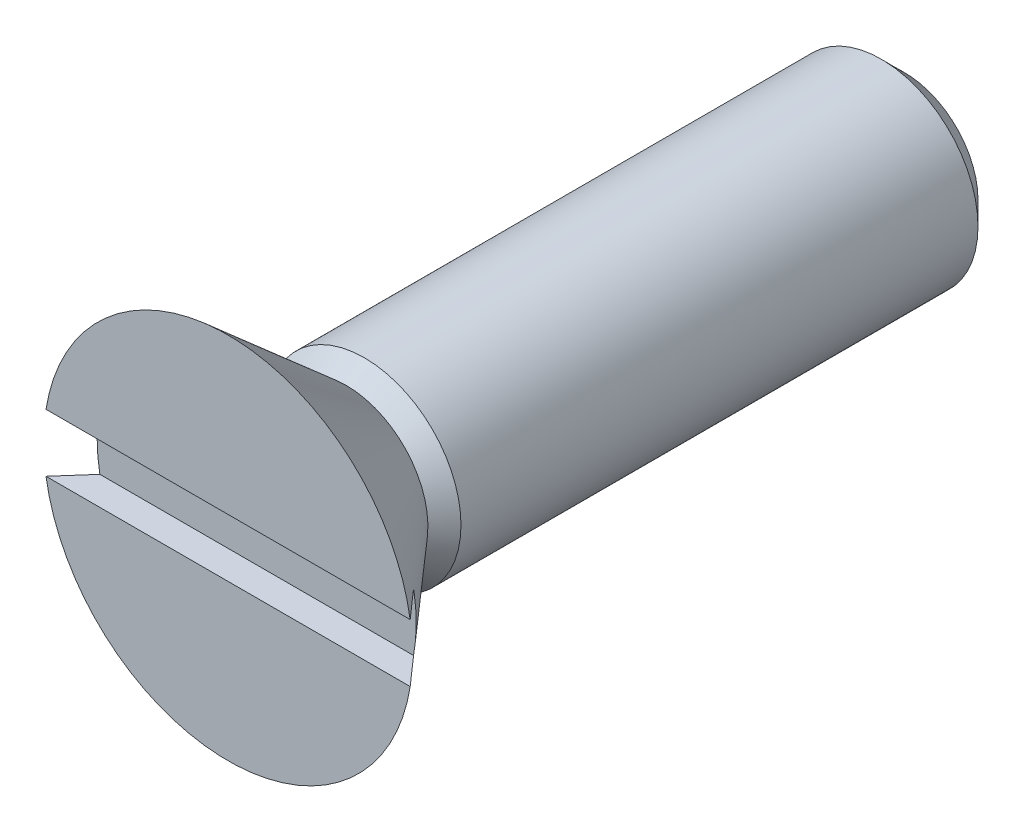
ISO-10303-21;
HEADER;
FILE_DESCRIPTION(('STEP AP214'),'2;1');
FILE_NAME('part.step','',(''),(''),'','','');
FILE_SCHEMA(('AUTOMOTIVE_DESIGN { 1 0 10303 214 1 1 1 1 }'));
ENDSEC;
DATA;
#1=APPLICATION_CONTEXT('core data for automotive mechanical design processes');
#2=APPLICATION_PROTOCOL_DEFINITION('international standard','automotive_design',2000,#1);
#3=PRODUCT_CONTEXT('',#1,'mechanical');
#4=PRODUCT('Part','Part','',(#3));
#5=PRODUCT_RELATED_PRODUCT_CATEGORY('part','',(#4));
#6=PRODUCT_DEFINITION_FORMATION('','',#4);
#7=PRODUCT_DEFINITION_CONTEXT('part definition',#1,'design');
#8=PRODUCT_DEFINITION('design','',#6,#7);
#9=PRODUCT_DEFINITION_SHAPE('','',#8);
#10=(LENGTH_UNIT() NAMED_UNIT(*) SI_UNIT(.MILLI.,.METRE.));
#11=(NAMED_UNIT(*) PLANE_ANGLE_UNIT() SI_UNIT($,.RADIAN.));
#12=(NAMED_UNIT(*) SI_UNIT($,.STERADIAN.) SOLID_ANGLE_UNIT());
#13=UNCERTAINTY_MEASURE_WITH_UNIT(LENGTH_MEASURE(1.E-05),#10,'distance_accuracy_value','');
#14=(GEOMETRIC_REPRESENTATION_CONTEXT(3) GLOBAL_UNCERTAINTY_ASSIGNED_CONTEXT((#13)) GLOBAL_UNIT_ASSIGNED_CONTEXT((#10,
#11,#12)) REPRESENTATION_CONTEXT('',''));
#15=CARTESIAN_POINT('',(0.,0.,0.));
#16=DIRECTION('',(0.,0.,1.));
#17=DIRECTION('',(1.,0.,0.));
#18=AXIS2_PLACEMENT_3D('',#15,#16,#17);
#19=CARTESIAN_POINT('',(-2.441956,-2.441956,0.));
#20=DIRECTION('',(0.,0.,1.));
#21=DIRECTION('',(1.,0.,0.));
#22=AXIS2_PLACEMENT_3D('',#19,#20,#21);
#23=PLANE('',#22);
#24=CARTESIAN_POINT('',(0.,0.,0.));
#25=DIRECTION('',(0.,0.,1.));
#26=DIRECTION('',(1.,0.,0.));
#27=AXIS2_PLACEMENT_3D('',#24,#25,#26);
#28=CIRCLE('',#27,2.413);
#29=CARTESIAN_POINT('',(2.413,0.,0.));
#30=VERTEX_POINT('',#29);
#31=EDGE_CURVE('E94',#30,#30,#28,.F.);
#32=ORIENTED_EDGE('',*,*,#31,.T.);
#33=EDGE_LOOP('',(#32));
#34=FACE_BOUND('',#33,.T.);
#35=ADVANCED_FACE('F17',(#34),#23,.F.);
#36=CARTESIAN_POINT('',(-6.054339894,-0.9525,21.2852));
#37=DIRECTION('',(0.,1.,0.));
#38=DIRECTION('',(0.,0.,1.));
#39=AXIS2_PLACEMENT_3D('',#36,#37,#38);
#40=PLANE('',#39);
#41=DIRECTION('',(1.,0.,0.));
#42=VECTOR('',#41,1.);
#43=CARTESIAN_POINT('',(0.,-0.9525,21.2852));
#44=LINE('',#43,#42);
#45=CARTESIAN_POINT('',(-5.15366288691652,-0.9525,21.2851999998263));
#46=VERTEX_POINT('',#45);
#47=CARTESIAN_POINT('',(5.15366288691652,-0.9525,21.2851999998263));
#48=VERTEX_POINT('',#47);
#49=EDGE_CURVE('E65',#46,#48,#44,.T.);
#50=ORIENTED_EDGE('',*,*,#49,.F.);
#51=CARTESIAN_POINT('',(-5.15366288549431,-0.9525,21.2851999982556));
#52=CARTESIAN_POINT('',(-5.5381400411626,-0.9525,21.7201245729036));
#53=CARTESIAN_POINT('',(-5.98254930127049,-0.9525,22.2249999983572));
#54=B_SPLINE_CURVE_WITH_KNOTS('',2,(#51,#52,#53),.UNSPECIFIED.,.F.,.F.,(3,3),(0.,1.),.UNSPECIFIED.);
#55=CARTESIAN_POINT('',(-5.98254930201713,-0.9525,22.2249999991786));
#56=VERTEX_POINT('',#55);
#57=EDGE_CURVE('E70',#46,#56,#54,.T.);
#58=ORIENTED_EDGE('',*,*,#57,.T.);
#59=DIRECTION('',(-1.,0.,0.));
#60=VECTOR('',#59,1.);
#61=CARTESIAN_POINT('',(0.,-0.9525,22.225));
#62=LINE('',#61,#60);
#63=CARTESIAN_POINT('',(5.98254930201713,-0.9525,22.2249999991786));
#64=VERTEX_POINT('',#63);
#65=EDGE_CURVE('E68',#64,#56,#62,.T.);
#66=ORIENTED_EDGE('',*,*,#65,.F.);
#67=CARTESIAN_POINT('',(5.98254930127049,-0.9525,22.2249999983572));
#68=CARTESIAN_POINT('',(5.53814004116295,-0.9525,21.720124572904));
#69=CARTESIAN_POINT('',(5.15366288549431,-0.9525,21.2851999982556));
#70=B_SPLINE_CURVE_WITH_KNOTS('',2,(#67,#68,#69),.UNSPECIFIED.,.F.,.F.,(3,3),(0.,1.),.UNSPECIFIED.);
#71=EDGE_CURVE('E58',#64,#48,#70,.T.);
#72=ORIENTED_EDGE('',*,*,#71,.T.);
#73=EDGE_LOOP('',(#50,#58,#66,#72));
#74=FACE_BOUND('',#73,.T.);
#75=ADVANCED_FACE('F63',(#74),#40,.T.);
#76=CARTESIAN_POINT('',(-6.054339894,0.9525,21.2852));
#77=DIRECTION('',(0.,1.,0.));
#78=DIRECTION('',(0.,0.,1.));
#79=AXIS2_PLACEMENT_3D('',#76,#77,#78);
#80=PLANE('',#79);
#81=DIRECTION('',(-1.,0.,0.));
#82=VECTOR('',#81,1.);
#83=CARTESIAN_POINT('',(0.,0.9525,21.2852));
#84=LINE('',#83,#82);
#85=CARTESIAN_POINT('',(5.15366288734051,0.9525,21.2852000002678));
#86=VERTEX_POINT('',#85);
#87=CARTESIAN_POINT('',(-5.15366288733301,0.9525,21.2852000002593));
#88=VERTEX_POINT('',#87);
#89=EDGE_CURVE('E79',#86,#88,#84,.T.);
#90=ORIENTED_EDGE('',*,*,#89,.F.);
#91=CARTESIAN_POINT('',(5.98254930116928,0.952499999391363,22.2249999990061));
#92=CARTESIAN_POINT('',(5.84456686314706,0.952499999695682,22.0682208816799));
#93=CARTESIAN_POINT('',(5.70650177762599,0.95249999989856,21.9115146579365));
#94=CARTESIAN_POINT('',(5.43020630602381,0.952500000101439,21.5982479913083));
#95=CARTESIAN_POINT('',(5.29197591993605,0.952500000101439,21.4416875484294));
#96=CARTESIAN_POINT('',(5.15366288634278,0.9525,21.2851999991391));
#97=B_SPLINE_CURVE_WITH_KNOTS('',3,(#91,#92,#93,#94,#95,#96),.UNSPECIFIED.,.F.,.F.,(4,2,4),(0.,
0.626553489814675,1.25310700485671),.UNSPECIFIED.);
#98=CARTESIAN_POINT('',(5.98254930216931,0.9525,22.2249999993246));
#99=VERTEX_POINT('',#98);
#100=EDGE_CURVE('E21',#99,#86,#97,.T.);
#101=ORIENTED_EDGE('',*,*,#100,.F.);
#102=DIRECTION('',(1.,0.,0.));
#103=VECTOR('',#102,1.);
#104=CARTESIAN_POINT('',(0.,0.9525,22.225));
#105=LINE('',#104,#103);
#106=CARTESIAN_POINT('',(-5.98254930216181,0.9525,22.2249999993161));
#107=VERTEX_POINT('',#106);
#108=EDGE_CURVE('E93',#107,#99,#105,.T.);
#109=ORIENTED_EDGE('',*,*,#108,.F.);
#110=CARTESIAN_POINT('',(-5.15366288612461,0.952499999689459,21.2851999993008));
#111=CARTESIAN_POINT('',(-5.29197591975175,0.952499999844729,21.4416875485611));
#112=CARTESIAN_POINT('',(-5.43020630590716,0.952499999948243,21.5982479913803));
#113=CARTESIAN_POINT('',(-5.70650177771204,0.952500000051757,21.9115146578297));
#114=CARTESIAN_POINT('',(-5.84456686336818,0.952500000051757,22.0682208814541));
#115=CARTESIAN_POINT('',(-5.98254930155923,0.9525,22.2249999986315));
#116=B_SPLINE_CURVE_WITH_KNOTS('',3,(#110,#111,#112,#113,#114,#115),.UNSPECIFIED.,.F.,.F.,(4,2,
4),(0.,0.626553515042203,1.25310700485663),.UNSPECIFIED.);
#117=EDGE_CURVE('E96',#88,#107,#116,.T.);
#118=ORIENTED_EDGE('',*,*,#117,.F.);
#119=EDGE_LOOP('',(#90,#101,#109,#118));
#120=FACE_BOUND('',#119,.T.);
#121=ADVANCED_FACE('F104',(#120),#80,.F.);
#122=CARTESIAN_POINT('',(0.,0.,0.));
#123=DIRECTION('',(0.,0.,1.));
#124=DIRECTION('',(1.,0.,0.));
#125=AXIS2_PLACEMENT_3D('',#122,#123,#124);
#126=CONICAL_SURFACE('',#125,2.413,0.785398163397448);
#127=ORIENTED_EDGE('',*,*,#31,.F.);
#128=EDGE_LOOP('',(#127));
#129=FACE_BOUND('',#128,.T.);
#130=CARTESIAN_POINT('',(0.,0.,0.762));
#131=DIRECTION('',(0.,0.,1.));
#132=DIRECTION('',(1.,0.,0.));
#133=AXIS2_PLACEMENT_3D('',#130,#131,#132);
#134=CIRCLE('',#133,3.175);
#135=CARTESIAN_POINT('',(3.175,0.,0.762));
#136=VERTEX_POINT('',#135);
#137=EDGE_CURVE('E89',#136,#136,#134,.F.);
#138=ORIENTED_EDGE('',*,*,#137,.T.);
#139=EDGE_LOOP('',(#138));
#140=FACE_BOUND('',#139,.T.);
#141=ADVANCED_FACE('F109',(#129,#140),#126,.T.);
#142=CARTESIAN_POINT('',(-6.054339894,-6.0885324,22.225));
#143=DIRECTION('',(0.,0.,1.));
#144=DIRECTION('',(1.,0.,0.));
#145=AXIS2_PLACEMENT_3D('',#142,#143,#144);
#146=PLANE('',#145);
#147=CARTESIAN_POINT('',(0.,0.,22.2249999999999));
#148=DIRECTION('',(0.,0.,1.));
#149=DIRECTION('',(1.,0.,0.));
#150=AXIS2_PLACEMENT_3D('',#147,#148,#149);
#151=CIRCLE('',#150,6.05789999999995);
#152=EDGE_CURVE('E85',#56,#64,#151,.T.);
#153=ORIENTED_EDGE('',*,*,#152,.T.);
#154=ORIENTED_EDGE('',*,*,#65,.T.);
#155=EDGE_LOOP('',(#153,#154));
#156=FACE_BOUND('',#155,.T.);
#157=ADVANCED_FACE('F112',(#156),#146,.T.);
#158=CARTESIAN_POINT('',(-5.303835656,-0.9525,21.2852));
#159=DIRECTION('',(0.,0.,1.));
#160=DIRECTION('',(1.,0.,0.));
#161=AXIS2_PLACEMENT_3D('',#158,#159,#160);
#162=PLANE('',#161);
#163=ORIENTED_EDGE('',*,*,#89,.T.);
#164=CARTESIAN_POINT('',(0.,0.,21.285200001397));
#165=DIRECTION('',(0.,0.,1.));
#166=DIRECTION('',(1.,0.,0.));
#167=AXIS2_PLACEMENT_3D('',#164,#165,#166);
#168=CIRCLE('',#167,5.24094432489413);
#169=EDGE_CURVE('E78',#88,#46,#168,.T.);
#170=ORIENTED_EDGE('',*,*,#169,.T.);
#171=ORIENTED_EDGE('',*,*,#49,.T.);
#172=CARTESIAN_POINT('',(0.,0.,21.285200001397));
#173=DIRECTION('',(0.,0.,1.));
#174=DIRECTION('',(1.,0.,0.));
#175=AXIS2_PLACEMENT_3D('',#172,#173,#174);
#176=CIRCLE('',#175,5.24094432489413);
#177=EDGE_CURVE('E76',#48,#86,#176,.T.);
#178=ORIENTED_EDGE('',*,*,#177,.T.);
#179=EDGE_LOOP('',(#163,#170,#171,#178));
#180=FACE_BOUND('',#179,.T.);
#181=ADVANCED_FACE('F75',(#180),#162,.T.);
#182=CARTESIAN_POINT('',(-6.054339894,0.9525,22.225));
#183=DIRECTION('',(0.,0.,1.));
#184=DIRECTION('',(1.,0.,0.));
#185=AXIS2_PLACEMENT_3D('',#182,#183,#184);
#186=PLANE('',#185);
#187=CARTESIAN_POINT('',(0.,0.,22.225));
#188=DIRECTION('',(0.,0.,1.));
#189=DIRECTION('',(1.,0.,0.));
#190=AXIS2_PLACEMENT_3D('',#187,#188,#189);
#191=CIRCLE('',#190,6.0579);
#192=EDGE_CURVE('E84',#99,#107,#191,.T.);
#193=ORIENTED_EDGE('',*,*,#192,.T.);
#194=ORIENTED_EDGE('',*,*,#108,.T.);
#195=EDGE_LOOP('',(#193,#194));
#196=FACE_BOUND('',#195,.T.);
#197=ADVANCED_FACE('F19',(#196),#186,.T.);
#198=CARTESIAN_POINT('',(0.,0.,0.762));
#199=DIRECTION('',(0.,0.,1.));
#200=DIRECTION('',(0.,-1.,0.));
#201=AXIS2_PLACEMENT_3D('',#198,#199,#200);
#202=CYLINDRICAL_SURFACE('',#201,3.175);
#203=ORIENTED_EDGE('',*,*,#137,.F.);
#204=EDGE_LOOP('',(#203));
#205=FACE_BOUND('',#204,.T.);
#206=CARTESIAN_POINT('',(0.,0.,17.7484980830001));
#207=DIRECTION('',(0.,0.,-1.));
#208=DIRECTION('',(0.,1.,0.));
#209=AXIS2_PLACEMENT_3D('',#206,#207,#208);
#210=CIRCLE('',#209,3.175);
#211=CARTESIAN_POINT('',(0.,3.175,17.748498083));
#212=VERTEX_POINT('',#211);
#213=EDGE_CURVE('E32',#212,#212,#210,.T.);
#214=ORIENTED_EDGE('',*,*,#213,.T.);
#215=EDGE_LOOP('',(#214));
#216=FACE_BOUND('',#215,.T.);
#217=ADVANCED_FACE('F121',(#205,#216),#202,.T.);
#218=CARTESIAN_POINT('',(0.,0.,18.3388));
#219=DIRECTION('',(0.,0.,1.));
#220=DIRECTION('',(1.,0.,0.));
#221=AXIS2_PLACEMENT_3D('',#218,#219,#220);
#222=CONICAL_SURFACE('',#221,2.679677879,0.715584993390751);
#223=ORIENTED_EDGE('',*,*,#152,.F.);
#224=ORIENTED_EDGE('',*,*,#57,.F.);
#225=ORIENTED_EDGE('',*,*,#169,.F.);
#226=ORIENTED_EDGE('',*,*,#117,.T.);
#227=ORIENTED_EDGE('',*,*,#192,.F.);
#228=ORIENTED_EDGE('',*,*,#100,.T.);
#229=ORIENTED_EDGE('',*,*,#177,.F.);
#230=ORIENTED_EDGE('',*,*,#71,.F.);
#231=EDGE_LOOP('',(#223,#224,#225,#226,#227,#228,#229,#230));
#232=FACE_BOUND('',#231,.T.);
#233=CARTESIAN_POINT('',(0.,0.,18.3388));
#234=DIRECTION('',(0.,0.,-1.));
#235=DIRECTION('',(0.,1.,0.));
#236=AXIS2_PLACEMENT_3D('',#233,#234,#235);
#237=CIRCLE('',#236,2.679677879);
#238=CARTESIAN_POINT('',(0.,2.679677879,18.3388));
#239=VERTEX_POINT('',#238);
#240=EDGE_CURVE('E11',#239,#239,#237,.F.);
#241=ORIENTED_EDGE('',*,*,#240,.T.);
#242=EDGE_LOOP('',(#241));
#243=FACE_BOUND('',#242,.T.);
#244=ADVANCED_FACE('F81',(#232,#243),#222,.T.);
#245=CARTESIAN_POINT('',(0.,0.,18.3388));
#246=DIRECTION('',(0.,0.,-1.));
#247=DIRECTION('',(-1.,0.,0.));
#248=AXIS2_PLACEMENT_3D('',#245,#246,#247);
#249=CONICAL_SURFACE('',#248,2.679677879,0.698131700958832);
#250=ORIENTED_EDGE('',*,*,#240,.F.);
#251=EDGE_LOOP('',(#250));
#252=FACE_BOUND('',#251,.T.);
#253=ORIENTED_EDGE('',*,*,#213,.F.);
#254=EDGE_LOOP('',(#253));
#255=FACE_BOUND('',#254,.T.);
#256=ADVANCED_FACE('F123',(#252,#255),#249,.T.);
#257=CLOSED_SHELL('',(#35,#75,#121,#141,#157,#181,#197,#217,#244,#256));
#258=MANIFOLD_SOLID_BREP('B1',#257);
#259=ADVANCED_BREP_SHAPE_REPRESENTATION('',(#18,#258),#14);
#260=SHAPE_DEFINITION_REPRESENTATION(#9,#259);
ENDSEC;
END-ISO-10303-21;
